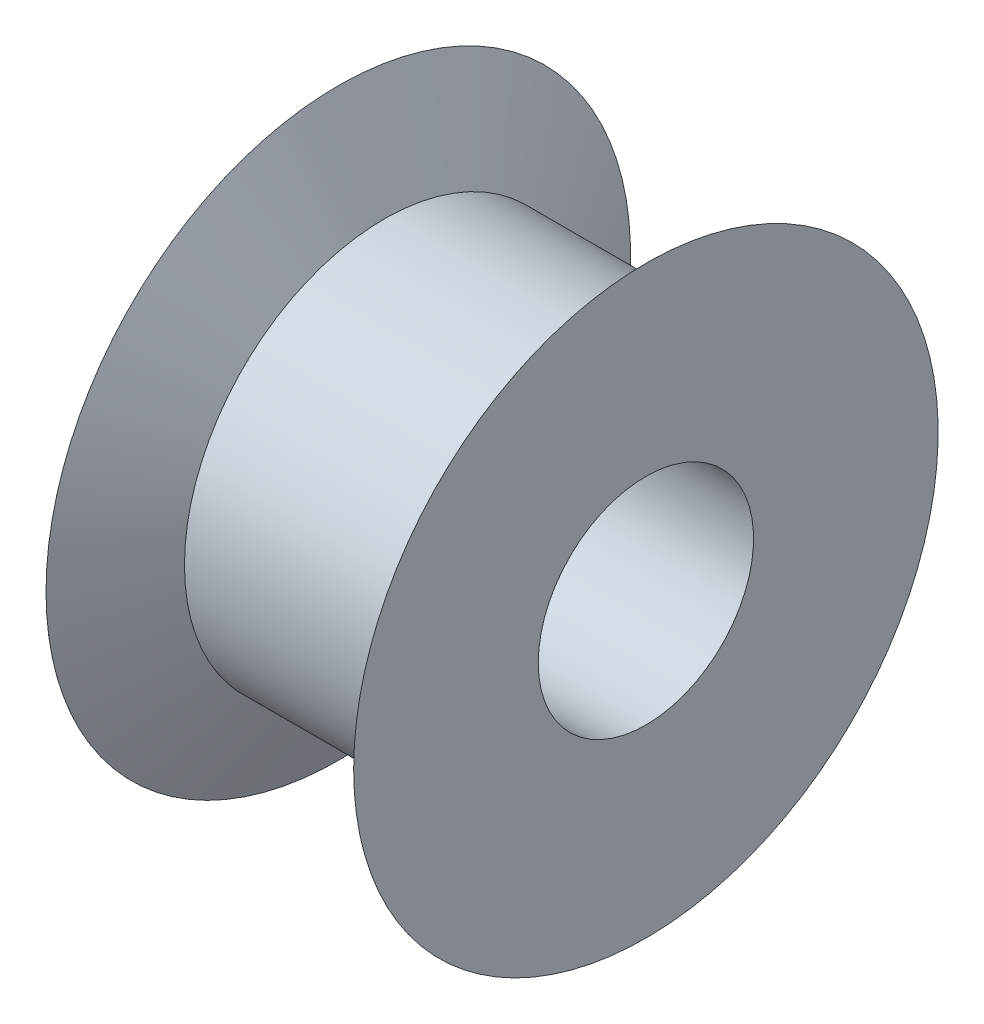
ISO-10303-21;
HEADER;
FILE_DESCRIPTION(('STEP AP214'),'2;1');
FILE_NAME('part.step','',(''),(''),'','','');
FILE_SCHEMA(('AUTOMOTIVE_DESIGN { 1 0 10303 214 1 1 1 1 }'));
ENDSEC;
DATA;
#1=APPLICATION_CONTEXT('core data for automotive mechanical design processes');
#2=APPLICATION_PROTOCOL_DEFINITION('international standard','automotive_design',2000,#1);
#3=PRODUCT_CONTEXT('',#1,'mechanical');
#4=PRODUCT('Part','Part','',(#3));
#5=PRODUCT_RELATED_PRODUCT_CATEGORY('part','',(#4));
#6=PRODUCT_DEFINITION_FORMATION('','',#4);
#7=PRODUCT_DEFINITION_CONTEXT('part definition',#1,'design');
#8=PRODUCT_DEFINITION('design','',#6,#7);
#9=PRODUCT_DEFINITION_SHAPE('','',#8);
#10=(LENGTH_UNIT() NAMED_UNIT(*) SI_UNIT(.MILLI.,.METRE.));
#11=(NAMED_UNIT(*) PLANE_ANGLE_UNIT() SI_UNIT($,.RADIAN.));
#12=(NAMED_UNIT(*) SI_UNIT($,.STERADIAN.) SOLID_ANGLE_UNIT());
#13=UNCERTAINTY_MEASURE_WITH_UNIT(LENGTH_MEASURE(1.E-05),#10,'distance_accuracy_value','');
#14=(GEOMETRIC_REPRESENTATION_CONTEXT(3) GLOBAL_UNCERTAINTY_ASSIGNED_CONTEXT((#13)) GLOBAL_UNIT_ASSIGNED_CONTEXT((#10,
#11,#12)) REPRESENTATION_CONTEXT('',''));
#15=CARTESIAN_POINT('',(0.,0.,0.));
#16=DIRECTION('',(0.,0.,1.));
#17=DIRECTION('',(1.,0.,0.));
#18=AXIS2_PLACEMENT_3D('',#15,#16,#17);
#19=CARTESIAN_POINT('',(21.7411584458016,0.,-9.5));
#20=DIRECTION('',(-1.,0.,0.));
#21=DIRECTION('',(0.,0.,1.));
#22=AXIS2_PLACEMENT_3D('',#19,#20,#21);
#23=PLANE('',#22);
#24=CARTESIAN_POINT('',(21.7411584458016,0.,0.));
#25=DIRECTION('',(-1.,0.,0.));
#26=DIRECTION('',(0.,0.,1.));
#27=AXIS2_PLACEMENT_3D('',#24,#25,#26);
#28=CIRCLE('',#27,9.5);
#29=CARTESIAN_POINT('',(21.7411584458016,0.,9.5));
#30=VERTEX_POINT('',#29);
#31=EDGE_CURVE('E53',#30,#30,#28,.T.);
#32=ORIENTED_EDGE('',*,*,#31,.F.);
#33=EDGE_LOOP('',(#32));
#34=FACE_BOUND('',#33,.T.);
#35=CARTESIAN_POINT('',(21.7411584458016,0.,0.));
#36=DIRECTION('',(-1.,0.,0.));
#37=DIRECTION('',(0.,0.,1.));
#38=AXIS2_PLACEMENT_3D('',#35,#36,#37);
#39=CIRCLE('',#38,3.5);
#40=CARTESIAN_POINT('',(21.7411584458016,0.,3.5));
#41=VERTEX_POINT('',#40);
#42=EDGE_CURVE('E10',#41,#41,#39,.T.);
#43=ORIENTED_EDGE('',*,*,#42,.T.);
#44=EDGE_LOOP('',(#43));
#45=FACE_BOUND('',#44,.T.);
#46=ADVANCED_FACE('F31',(#34,#45),#23,.F.);
#47=CARTESIAN_POINT('',(0.,0.,0.));
#48=DIRECTION('',(-1.,0.,0.));
#49=DIRECTION('',(0.,0.,1.));
#50=AXIS2_PLACEMENT_3D('',#47,#48,#49);
#51=CYLINDRICAL_SURFACE('',#50,3.5);
#52=ORIENTED_EDGE('',*,*,#42,.F.);
#53=EDGE_LOOP('',(#52));
#54=FACE_BOUND('',#53,.T.);
#55=CARTESIAN_POINT('',(11.7411584458016,0.,0.));
#56=DIRECTION('',(-1.,0.,0.));
#57=DIRECTION('',(0.,0.,1.));
#58=AXIS2_PLACEMENT_3D('',#55,#56,#57);
#59=CIRCLE('',#58,3.5);
#60=CARTESIAN_POINT('',(11.7411584458016,0.,3.5));
#61=VERTEX_POINT('',#60);
#62=EDGE_CURVE('E37',#61,#61,#59,.T.);
#63=ORIENTED_EDGE('',*,*,#62,.T.);
#64=EDGE_LOOP('',(#63));
#65=FACE_BOUND('',#64,.T.);
#66=ADVANCED_FACE('F60',(#54,#65),#51,.F.);
#67=CARTESIAN_POINT('',(11.7411584458016,0.,-3.5));
#68=DIRECTION('',(1.,0.,0.));
#69=DIRECTION('',(0.,0.,-1.));
#70=AXIS2_PLACEMENT_3D('',#67,#68,#69);
#71=PLANE('',#70);
#72=ORIENTED_EDGE('',*,*,#62,.F.);
#73=EDGE_LOOP('',(#72));
#74=FACE_BOUND('',#73,.T.);
#75=CARTESIAN_POINT('',(11.7411584458016,0.,0.));
#76=DIRECTION('',(-1.,0.,0.));
#77=DIRECTION('',(0.,0.,1.));
#78=AXIS2_PLACEMENT_3D('',#75,#76,#77);
#79=CIRCLE('',#78,9.5);
#80=CARTESIAN_POINT('',(11.7411584458016,0.,9.5));
#81=VERTEX_POINT('',#80);
#82=EDGE_CURVE('E41',#81,#81,#79,.T.);
#83=ORIENTED_EDGE('',*,*,#82,.T.);
#84=EDGE_LOOP('',(#83));
#85=FACE_BOUND('',#84,.T.);
#86=ADVANCED_FACE('F64',(#74,#85),#71,.F.);
#87=CARTESIAN_POINT('',(13.2411584458016,0.,0.));
#88=DIRECTION('',(-1.,0.,0.));
#89=DIRECTION('',(0.,0.,1.));
#90=AXIS2_PLACEMENT_3D('',#87,#88,#89);
#91=CONICAL_SURFACE('',#90,6.5,1.10714871779409);
#92=ORIENTED_EDGE('',*,*,#82,.F.);
#93=EDGE_LOOP('',(#92));
#94=FACE_BOUND('',#93,.T.);
#95=CARTESIAN_POINT('',(13.2411584458016,0.,0.));
#96=DIRECTION('',(-1.,0.,0.));
#97=DIRECTION('',(0.,0.,1.));
#98=AXIS2_PLACEMENT_3D('',#95,#96,#97);
#99=CIRCLE('',#98,6.5);
#100=CARTESIAN_POINT('',(13.2411584458016,0.,6.5));
#101=VERTEX_POINT('',#100);
#102=EDGE_CURVE('E45',#101,#101,#99,.T.);
#103=ORIENTED_EDGE('',*,*,#102,.T.);
#104=EDGE_LOOP('',(#103));
#105=FACE_BOUND('',#104,.T.);
#106=ADVANCED_FACE('F69',(#94,#105),#91,.T.);
#107=CARTESIAN_POINT('',(0.,0.,0.));
#108=DIRECTION('',(-1.,0.,0.));
#109=DIRECTION('',(0.,0.,1.));
#110=AXIS2_PLACEMENT_3D('',#107,#108,#109);
#111=CYLINDRICAL_SURFACE('',#110,6.5);
#112=ORIENTED_EDGE('',*,*,#102,.F.);
#113=EDGE_LOOP('',(#112));
#114=FACE_BOUND('',#113,.T.);
#115=CARTESIAN_POINT('',(20.2411584458016,0.,0.));
#116=DIRECTION('',(-1.,0.,0.));
#117=DIRECTION('',(0.,0.,1.));
#118=AXIS2_PLACEMENT_3D('',#115,#116,#117);
#119=CIRCLE('',#118,6.5);
#120=CARTESIAN_POINT('',(20.2411584458016,0.,6.5));
#121=VERTEX_POINT('',#120);
#122=EDGE_CURVE('E50',#121,#121,#119,.T.);
#123=ORIENTED_EDGE('',*,*,#122,.T.);
#124=EDGE_LOOP('',(#123));
#125=FACE_BOUND('',#124,.T.);
#126=ADVANCED_FACE('F75',(#114,#125),#111,.T.);
#127=CARTESIAN_POINT('',(21.7411584458016,0.,0.));
#128=DIRECTION('',(1.,0.,0.));
#129=DIRECTION('',(0.,0.,-1.));
#130=AXIS2_PLACEMENT_3D('',#127,#128,#129);
#131=CONICAL_SURFACE('',#130,9.5,1.10714871779409);
#132=ORIENTED_EDGE('',*,*,#122,.F.);
#133=EDGE_LOOP('',(#132));
#134=FACE_BOUND('',#133,.T.);
#135=ORIENTED_EDGE('',*,*,#31,.T.);
#136=EDGE_LOOP('',(#135));
#137=FACE_BOUND('',#136,.T.);
#138=ADVANCED_FACE('F57',(#134,#137),#131,.T.);
#139=CLOSED_SHELL('',(#46,#66,#86,#106,#126,#138));
#140=MANIFOLD_SOLID_BREP('B2',#139);
#141=ADVANCED_BREP_SHAPE_REPRESENTATION('',(#18,#140),#14);
#142=SHAPE_DEFINITION_REPRESENTATION(#9,#141);
ENDSEC;
END-ISO-10303-21;
